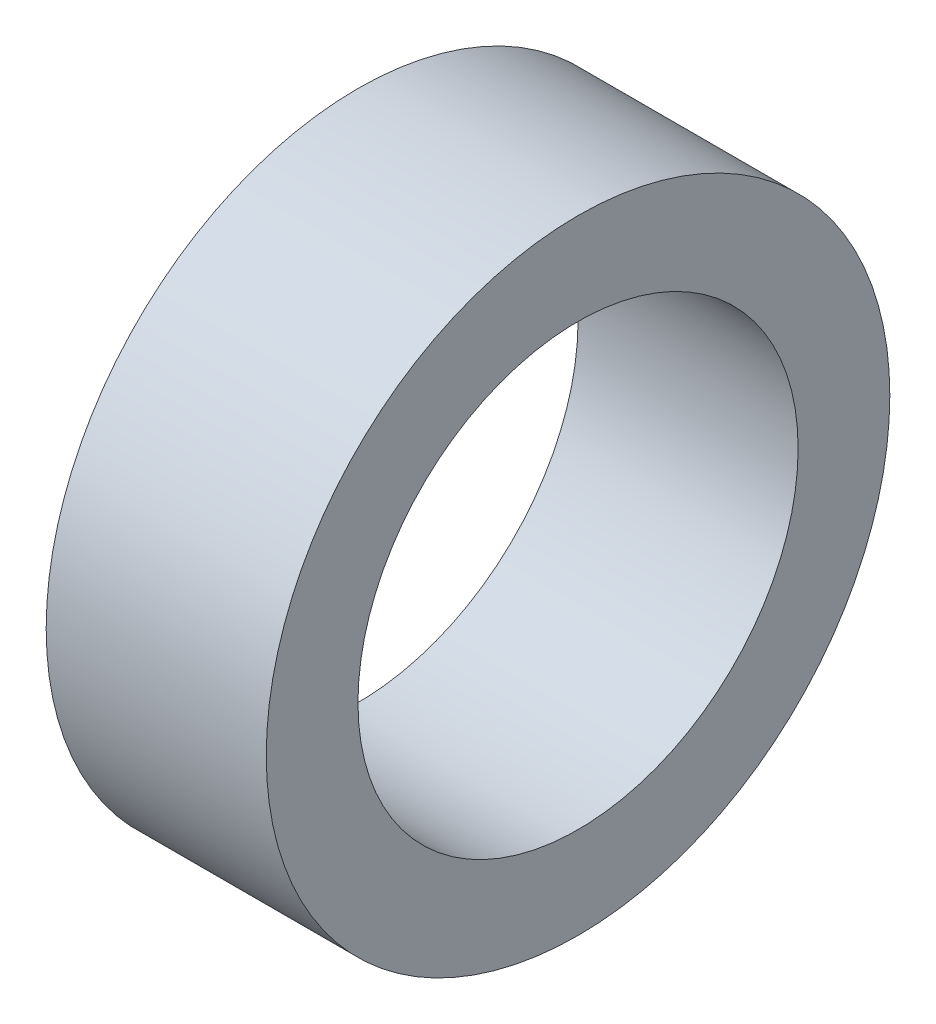
ISO-10303-21;
HEADER;
FILE_DESCRIPTION(('STEP AP214'),'2;1');
FILE_NAME('part.step','',(''),(''),'','','');
FILE_SCHEMA(('AUTOMOTIVE_DESIGN { 1 0 10303 214 1 1 1 1 }'));
ENDSEC;
DATA;
#1=APPLICATION_CONTEXT('core data for automotive mechanical design processes');
#2=APPLICATION_PROTOCOL_DEFINITION('international standard','automotive_design',2000,#1);
#3=PRODUCT_CONTEXT('',#1,'mechanical');
#4=PRODUCT('Part','Part','',(#3));
#5=PRODUCT_RELATED_PRODUCT_CATEGORY('part','',(#4));
#6=PRODUCT_DEFINITION_FORMATION('','',#4);
#7=PRODUCT_DEFINITION_CONTEXT('part definition',#1,'design');
#8=PRODUCT_DEFINITION('design','',#6,#7);
#9=PRODUCT_DEFINITION_SHAPE('','',#8);
#10=(LENGTH_UNIT() NAMED_UNIT(*) SI_UNIT(.MILLI.,.METRE.));
#11=(NAMED_UNIT(*) PLANE_ANGLE_UNIT() SI_UNIT($,.RADIAN.));
#12=(NAMED_UNIT(*) SI_UNIT($,.STERADIAN.) SOLID_ANGLE_UNIT());
#13=UNCERTAINTY_MEASURE_WITH_UNIT(LENGTH_MEASURE(1.E-05),#10,'distance_accuracy_value','');
#14=(GEOMETRIC_REPRESENTATION_CONTEXT(3) GLOBAL_UNCERTAINTY_ASSIGNED_CONTEXT((#13)) GLOBAL_UNIT_ASSIGNED_CONTEXT((#10,
#11,#12)) REPRESENTATION_CONTEXT('',''));
#15=CARTESIAN_POINT('',(0.,0.,0.));
#16=DIRECTION('',(0.,0.,1.));
#17=DIRECTION('',(1.,0.,0.));
#18=AXIS2_PLACEMENT_3D('',#15,#16,#17);
#19=CARTESIAN_POINT('',(0.,4.25,0.));
#20=DIRECTION('',(1.,0.,0.));
#21=DIRECTION('',(0.,0.,-1.));
#22=AXIS2_PLACEMENT_3D('',#19,#20,#21);
#23=PLANE('',#22);
#24=CARTESIAN_POINT('',(0.,0.,0.));
#25=DIRECTION('',(-1.,0.,0.));
#26=DIRECTION('',(0.,0.,1.));
#27=AXIS2_PLACEMENT_3D('',#24,#25,#26);
#28=CIRCLE('',#27,3.);
#29=CARTESIAN_POINT('',(0.,0.,3.));
#30=VERTEX_POINT('',#29);
#31=EDGE_CURVE('E10',#30,#30,#28,.T.);
#32=ORIENTED_EDGE('',*,*,#31,.F.);
#33=EDGE_LOOP('',(#32));
#34=FACE_BOUND('',#33,.T.);
#35=CARTESIAN_POINT('',(0.,0.,0.));
#36=DIRECTION('',(-1.,0.,0.));
#37=DIRECTION('',(0.,0.,1.));
#38=AXIS2_PLACEMENT_3D('',#35,#36,#37);
#39=CIRCLE('',#38,4.25);
#40=CARTESIAN_POINT('',(0.,0.,4.25));
#41=VERTEX_POINT('',#40);
#42=EDGE_CURVE('E58',#41,#41,#39,.T.);
#43=ORIENTED_EDGE('',*,*,#42,.T.);
#44=EDGE_LOOP('',(#43));
#45=FACE_BOUND('',#44,.T.);
#46=ADVANCED_FACE('F41',(#34,#45),#23,.F.);
#47=CARTESIAN_POINT('',(-88.99,0.,0.));
#48=DIRECTION('',(-1.,0.,0.));
#49=DIRECTION('',(0.,0.,1.));
#50=AXIS2_PLACEMENT_3D('',#47,#48,#49);
#51=CYLINDRICAL_SURFACE('',#50,3.);
#52=CARTESIAN_POINT('',(3.,0.,0.));
#53=DIRECTION('',(-1.,0.,0.));
#54=DIRECTION('',(0.,0.,1.));
#55=AXIS2_PLACEMENT_3D('',#52,#53,#54);
#56=CIRCLE('',#55,3.);
#57=CARTESIAN_POINT('',(3.,0.,3.));
#58=VERTEX_POINT('',#57);
#59=EDGE_CURVE('E48',#58,#58,#56,.T.);
#60=ORIENTED_EDGE('',*,*,#59,.F.);
#61=EDGE_LOOP('',(#60));
#62=FACE_BOUND('',#61,.T.);
#63=ORIENTED_EDGE('',*,*,#31,.T.);
#64=EDGE_LOOP('',(#63));
#65=FACE_BOUND('',#64,.T.);
#66=ADVANCED_FACE('F74',(#62,#65),#51,.F.);
#67=CARTESIAN_POINT('',(3.,4.25,0.));
#68=DIRECTION('',(-1.,0.,0.));
#69=DIRECTION('',(0.,0.,1.));
#70=AXIS2_PLACEMENT_3D('',#67,#68,#69);
#71=PLANE('',#70);
#72=CARTESIAN_POINT('',(3.,0.,0.));
#73=DIRECTION('',(-1.,0.,0.));
#74=DIRECTION('',(0.,0.,1.));
#75=AXIS2_PLACEMENT_3D('',#72,#73,#74);
#76=CIRCLE('',#75,4.25);
#77=CARTESIAN_POINT('',(3.,0.,4.25));
#78=VERTEX_POINT('',#77);
#79=EDGE_CURVE('E53',#78,#78,#76,.T.);
#80=ORIENTED_EDGE('',*,*,#79,.F.);
#81=EDGE_LOOP('',(#80));
#82=FACE_BOUND('',#81,.T.);
#83=ORIENTED_EDGE('',*,*,#59,.T.);
#84=EDGE_LOOP('',(#83));
#85=FACE_BOUND('',#84,.T.);
#86=ADVANCED_FACE('F69',(#82,#85),#71,.F.);
#87=CARTESIAN_POINT('',(-88.99,0.,0.));
#88=DIRECTION('',(-1.,0.,0.));
#89=DIRECTION('',(0.,0.,1.));
#90=AXIS2_PLACEMENT_3D('',#87,#88,#89);
#91=CYLINDRICAL_SURFACE('',#90,4.25);
#92=ORIENTED_EDGE('',*,*,#42,.F.);
#93=EDGE_LOOP('',(#92));
#94=FACE_BOUND('',#93,.T.);
#95=ORIENTED_EDGE('',*,*,#79,.T.);
#96=EDGE_LOOP('',(#95));
#97=FACE_BOUND('',#96,.T.);
#98=ADVANCED_FACE('F66',(#94,#97),#91,.T.);
#99=CLOSED_SHELL('',(#46,#66,#86,#98));
#100=MANIFOLD_SOLID_BREP('B2',#99);
#101=ADVANCED_BREP_SHAPE_REPRESENTATION('',(#18,#100),#14);
#102=SHAPE_DEFINITION_REPRESENTATION(#9,#101);
ENDSEC;
END-ISO-10303-21;
